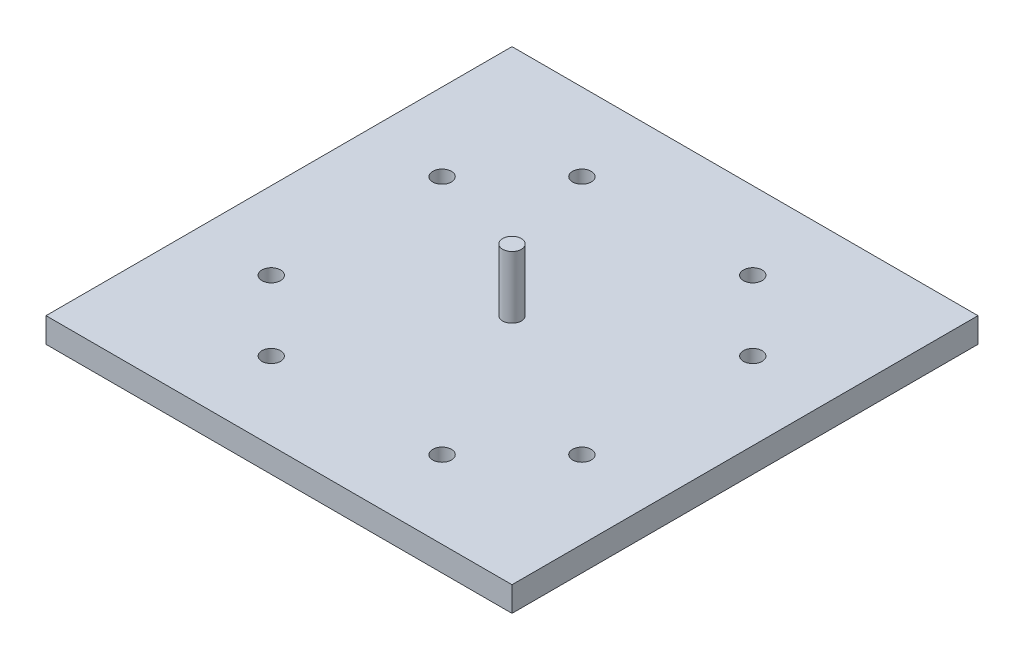
ISO-10303-21;
HEADER;
FILE_DESCRIPTION(('STEP AP214'),'2;1');
FILE_NAME('part.step','',(''),(''),'','','');
FILE_SCHEMA(('AUTOMOTIVE_DESIGN { 1 0 10303 214 1 1 1 1 }'));
ENDSEC;
DATA;
#1=APPLICATION_CONTEXT('core data for automotive mechanical design processes');
#2=APPLICATION_PROTOCOL_DEFINITION('international standard','automotive_design',2000,#1);
#3=PRODUCT_CONTEXT('',#1,'mechanical');
#4=PRODUCT('Part','Part','',(#3));
#5=PRODUCT_RELATED_PRODUCT_CATEGORY('part','',(#4));
#6=PRODUCT_DEFINITION_FORMATION('','',#4);
#7=PRODUCT_DEFINITION_CONTEXT('part definition',#1,'design');
#8=PRODUCT_DEFINITION('design','',#6,#7);
#9=PRODUCT_DEFINITION_SHAPE('','',#8);
#10=(LENGTH_UNIT() NAMED_UNIT(*) SI_UNIT(.MILLI.,.METRE.));
#11=(NAMED_UNIT(*) PLANE_ANGLE_UNIT() SI_UNIT($,.RADIAN.));
#12=(NAMED_UNIT(*) SI_UNIT($,.STERADIAN.) SOLID_ANGLE_UNIT());
#13=UNCERTAINTY_MEASURE_WITH_UNIT(LENGTH_MEASURE(1.E-05),#10,'distance_accuracy_value','');
#14=(GEOMETRIC_REPRESENTATION_CONTEXT(3) GLOBAL_UNCERTAINTY_ASSIGNED_CONTEXT((#13)) GLOBAL_UNIT_ASSIGNED_CONTEXT((#10,
#11,#12)) REPRESENTATION_CONTEXT('',''));
#15=CARTESIAN_POINT('',(0.,0.,0.));
#16=DIRECTION('',(0.,0.,1.));
#17=DIRECTION('',(1.,0.,0.));
#18=AXIS2_PLACEMENT_3D('',#15,#16,#17);
#19=CARTESIAN_POINT('',(0.,1.6,0.));
#20=DIRECTION('',(0.,0.,-1.));
#21=DIRECTION('',(-1.,0.,0.));
#22=AXIS2_PLACEMENT_3D('',#19,#20,#21);
#23=PLANE('',#22);
#24=DIRECTION('',(1.,0.,0.));
#25=VECTOR('',#24,1.);
#26=CARTESIAN_POINT('',(0.,0.,0.));
#27=LINE('',#26,#25);
#28=CARTESIAN_POINT('',(0.,0.,0.));
#29=VERTEX_POINT('',#28);
#30=CARTESIAN_POINT('',(30.,0.,0.));
#31=VERTEX_POINT('',#30);
#32=EDGE_CURVE('E111',#29,#31,#27,.T.);
#33=ORIENTED_EDGE('',*,*,#32,.T.);
#34=DIRECTION('',(0.,-1.,0.));
#35=VECTOR('',#34,1.);
#36=CARTESIAN_POINT('',(30.,1.6,0.));
#37=LINE('',#36,#35);
#38=CARTESIAN_POINT('',(30.,1.6,0.));
#39=VERTEX_POINT('',#38);
#40=EDGE_CURVE('E11',#39,#31,#37,.T.);
#41=ORIENTED_EDGE('',*,*,#40,.F.);
#42=DIRECTION('',(1.,0.,0.));
#43=VECTOR('',#42,1.);
#44=CARTESIAN_POINT('',(0.,1.6,0.));
#45=LINE('',#44,#43);
#46=CARTESIAN_POINT('',(0.,1.6,0.));
#47=VERTEX_POINT('',#46);
#48=EDGE_CURVE('E93',#47,#39,#45,.T.);
#49=ORIENTED_EDGE('',*,*,#48,.F.);
#50=DIRECTION('',(0.,-1.,0.));
#51=VECTOR('',#50,1.);
#52=CARTESIAN_POINT('',(0.,1.6,0.));
#53=LINE('',#52,#51);
#54=EDGE_CURVE('E60',#47,#29,#53,.T.);
#55=ORIENTED_EDGE('',*,*,#54,.T.);
#56=EDGE_LOOP('',(#33,#41,#49,#55));
#57=FACE_BOUND('',#56,.T.);
#58=ADVANCED_FACE('F43',(#57),#23,.F.);
#59=CARTESIAN_POINT('',(30.,1.6,0.));
#60=DIRECTION('',(-1.,0.,0.));
#61=DIRECTION('',(0.,0.,1.));
#62=AXIS2_PLACEMENT_3D('',#59,#60,#61);
#63=PLANE('',#62);
#64=DIRECTION('',(0.,0.,-1.));
#65=VECTOR('',#64,1.);
#66=CARTESIAN_POINT('',(30.,0.,0.));
#67=LINE('',#66,#65);
#68=CARTESIAN_POINT('',(30.,0.,-30.));
#69=VERTEX_POINT('',#68);
#70=EDGE_CURVE('E99',#31,#69,#67,.T.);
#71=ORIENTED_EDGE('',*,*,#70,.T.);
#72=DIRECTION('',(0.,-1.,0.));
#73=VECTOR('',#72,1.);
#74=CARTESIAN_POINT('',(30.,1.6,-30.));
#75=LINE('',#74,#73);
#76=CARTESIAN_POINT('',(30.,1.6,-30.));
#77=VERTEX_POINT('',#76);
#78=EDGE_CURVE('E52',#77,#69,#75,.T.);
#79=ORIENTED_EDGE('',*,*,#78,.F.);
#80=DIRECTION('',(0.,0.,-1.));
#81=VECTOR('',#80,1.);
#82=CARTESIAN_POINT('',(30.,1.6,0.));
#83=LINE('',#82,#81);
#84=EDGE_CURVE('E85',#39,#77,#83,.T.);
#85=ORIENTED_EDGE('',*,*,#84,.F.);
#86=ORIENTED_EDGE('',*,*,#40,.T.);
#87=EDGE_LOOP('',(#71,#79,#85,#86));
#88=FACE_BOUND('',#87,.T.);
#89=ADVANCED_FACE('F98',(#88),#63,.F.);
#90=CARTESIAN_POINT('',(0.,1.6,-30.));
#91=DIRECTION('',(0.,0.,-1.));
#92=DIRECTION('',(-1.,0.,0.));
#93=AXIS2_PLACEMENT_3D('',#90,#91,#92);
#94=PLANE('',#93);
#95=DIRECTION('',(1.,0.,0.));
#96=VECTOR('',#95,1.);
#97=CARTESIAN_POINT('',(0.,0.,-30.));
#98=LINE('',#97,#96);
#99=CARTESIAN_POINT('',(0.,0.,-30.));
#100=VERTEX_POINT('',#99);
#101=EDGE_CURVE('E117',#100,#69,#98,.T.);
#102=ORIENTED_EDGE('',*,*,#101,.F.);
#103=DIRECTION('',(0.,-1.,0.));
#104=VECTOR('',#103,1.);
#105=CARTESIAN_POINT('',(0.,1.6,-30.));
#106=LINE('',#105,#104);
#107=CARTESIAN_POINT('',(0.,1.6,-30.));
#108=VERTEX_POINT('',#107);
#109=EDGE_CURVE('E74',#108,#100,#106,.T.);
#110=ORIENTED_EDGE('',*,*,#109,.F.);
#111=DIRECTION('',(1.,0.,0.));
#112=VECTOR('',#111,1.);
#113=CARTESIAN_POINT('',(0.,1.6,-30.));
#114=LINE('',#113,#112);
#115=EDGE_CURVE('E92',#108,#77,#114,.T.);
#116=ORIENTED_EDGE('',*,*,#115,.T.);
#117=ORIENTED_EDGE('',*,*,#78,.T.);
#118=EDGE_LOOP('',(#102,#110,#116,#117));
#119=FACE_BOUND('',#118,.T.);
#120=ADVANCED_FACE('F103',(#119),#94,.T.);
#121=CARTESIAN_POINT('',(0.,1.6,0.));
#122=DIRECTION('',(-1.,0.,0.));
#123=DIRECTION('',(0.,0.,1.));
#124=AXIS2_PLACEMENT_3D('',#121,#122,#123);
#125=PLANE('',#124);
#126=DIRECTION('',(0.,0.,-1.));
#127=VECTOR('',#126,1.);
#128=CARTESIAN_POINT('',(0.,0.,0.));
#129=LINE('',#128,#127);
#130=EDGE_CURVE('E120',#29,#100,#129,.T.);
#131=ORIENTED_EDGE('',*,*,#130,.F.);
#132=ORIENTED_EDGE('',*,*,#54,.F.);
#133=DIRECTION('',(0.,0.,-1.));
#134=VECTOR('',#133,1.);
#135=CARTESIAN_POINT('',(0.,1.6,0.));
#136=LINE('',#135,#134);
#137=EDGE_CURVE('E105',#47,#108,#136,.T.);
#138=ORIENTED_EDGE('',*,*,#137,.T.);
#139=ORIENTED_EDGE('',*,*,#109,.T.);
#140=EDGE_LOOP('',(#131,#132,#138,#139));
#141=FACE_BOUND('',#140,.T.);
#142=ADVANCED_FACE('F214',(#141),#125,.T.);
#143=CARTESIAN_POINT('',(0.,1.6,0.));
#144=DIRECTION('',(0.,1.,0.));
#145=DIRECTION('',(0.,0.,1.));
#146=AXIS2_PLACEMENT_3D('',#143,#144,#145);
#147=PLANE('',#146);
#148=CARTESIAN_POINT('',(15.,1.6,-15.));
#149=DIRECTION('',(0.,1.,0.));
#150=DIRECTION('',(0.,0.,1.));
#151=AXIS2_PLACEMENT_3D('',#148,#149,#150);
#152=CIRCLE('',#151,0.6);
#153=CARTESIAN_POINT('',(15.,1.6,-14.4));
#154=VERTEX_POINT('',#153);
#155=EDGE_CURVE('E194',#154,#154,#152,.T.);
#156=ORIENTED_EDGE('',*,*,#155,.F.);
#157=EDGE_LOOP('',(#156));
#158=FACE_BOUND('',#157,.T.);
#159=CARTESIAN_POINT('',(25.,1.6,-9.50000000000003));
#160=DIRECTION('',(0.,1.,0.));
#161=DIRECTION('',(-1.,0.,0.));
#162=AXIS2_PLACEMENT_3D('',#159,#160,#161);
#163=CIRCLE('',#162,0.6);
#164=CARTESIAN_POINT('',(24.4,1.6,-9.50000000000003));
#165=VERTEX_POINT('',#164);
#166=EDGE_CURVE('E179',#165,#165,#163,.T.);
#167=ORIENTED_EDGE('',*,*,#166,.F.);
#168=EDGE_LOOP('',(#167));
#169=FACE_BOUND('',#168,.T.);
#170=CARTESIAN_POINT('',(4.99999999999998,1.6,-20.5));
#171=DIRECTION('',(0.,1.,0.));
#172=DIRECTION('',(-1.,0.,0.));
#173=AXIS2_PLACEMENT_3D('',#170,#171,#172);
#174=CIRCLE('',#173,0.6);
#175=CARTESIAN_POINT('',(4.39999999999998,1.6,-20.5));
#176=VERTEX_POINT('',#175);
#177=EDGE_CURVE('E170',#176,#176,#174,.T.);
#178=ORIENTED_EDGE('',*,*,#177,.F.);
#179=EDGE_LOOP('',(#178));
#180=FACE_BOUND('',#179,.T.);
#181=CARTESIAN_POINT('',(5.00000000000002,1.6,-9.49999999999996));
#182=DIRECTION('',(0.,1.,0.));
#183=DIRECTION('',(1.,0.,0.));
#184=AXIS2_PLACEMENT_3D('',#181,#182,#183);
#185=CIRCLE('',#184,0.6);
#186=CARTESIAN_POINT('',(5.60000000000001,1.6,-9.49999999999996));
#187=VERTEX_POINT('',#186);
#188=EDGE_CURVE('E186',#187,#187,#185,.T.);
#189=ORIENTED_EDGE('',*,*,#188,.F.);
#190=EDGE_LOOP('',(#189));
#191=FACE_BOUND('',#190,.T.);
#192=CARTESIAN_POINT('',(25.,1.6,-20.5));
#193=DIRECTION('',(0.,1.,0.));
#194=DIRECTION('',(1.,0.,0.));
#195=AXIS2_PLACEMENT_3D('',#192,#193,#194);
#196=CIRCLE('',#195,0.6);
#197=CARTESIAN_POINT('',(25.6,1.6,-20.5));
#198=VERTEX_POINT('',#197);
#199=EDGE_CURVE('E162',#198,#198,#196,.T.);
#200=ORIENTED_EDGE('',*,*,#199,.F.);
#201=EDGE_LOOP('',(#200));
#202=FACE_BOUND('',#201,.T.);
#203=CARTESIAN_POINT('',(9.5,1.6,-5.));
#204=DIRECTION('',(0.,1.,0.));
#205=DIRECTION('',(0.,0.,-1.));
#206=AXIS2_PLACEMENT_3D('',#203,#204,#205);
#207=CIRCLE('',#206,0.6);
#208=CARTESIAN_POINT('',(9.5,1.6,-5.6));
#209=VERTEX_POINT('',#208);
#210=EDGE_CURVE('E147',#209,#209,#207,.T.);
#211=ORIENTED_EDGE('',*,*,#210,.F.);
#212=EDGE_LOOP('',(#211));
#213=FACE_BOUND('',#212,.T.);
#214=CARTESIAN_POINT('',(20.5,1.6,-25.));
#215=DIRECTION('',(0.,1.,0.));
#216=DIRECTION('',(0.,0.,-1.));
#217=AXIS2_PLACEMENT_3D('',#214,#215,#216);
#218=CIRCLE('',#217,0.6);
#219=CARTESIAN_POINT('',(20.5,1.6,-25.6));
#220=VERTEX_POINT('',#219);
#221=EDGE_CURVE('E138',#220,#220,#218,.T.);
#222=ORIENTED_EDGE('',*,*,#221,.F.);
#223=EDGE_LOOP('',(#222));
#224=FACE_BOUND('',#223,.T.);
#225=CARTESIAN_POINT('',(9.5,1.6,-25.));
#226=DIRECTION('',(0.,1.,0.));
#227=DIRECTION('',(0.,0.,1.));
#228=AXIS2_PLACEMENT_3D('',#225,#226,#227);
#229=CIRCLE('',#228,0.6);
#230=CARTESIAN_POINT('',(9.5,1.6,-24.4));
#231=VERTEX_POINT('',#230);
#232=EDGE_CURVE('E154',#231,#231,#229,.T.);
#233=ORIENTED_EDGE('',*,*,#232,.F.);
#234=EDGE_LOOP('',(#233));
#235=FACE_BOUND('',#234,.T.);
#236=CARTESIAN_POINT('',(20.5,1.6,-5.));
#237=DIRECTION('',(0.,1.,0.));
#238=DIRECTION('',(0.,0.,1.));
#239=AXIS2_PLACEMENT_3D('',#236,#237,#238);
#240=CIRCLE('',#239,0.6);
#241=CARTESIAN_POINT('',(20.5,1.6,-4.4));
#242=VERTEX_POINT('',#241);
#243=EDGE_CURVE('E130',#242,#242,#240,.T.);
#244=ORIENTED_EDGE('',*,*,#243,.F.);
#245=EDGE_LOOP('',(#244));
#246=FACE_BOUND('',#245,.T.);
#247=ORIENTED_EDGE('',*,*,#48,.T.);
#248=ORIENTED_EDGE('',*,*,#84,.T.);
#249=ORIENTED_EDGE('',*,*,#115,.F.);
#250=ORIENTED_EDGE('',*,*,#137,.F.);
#251=EDGE_LOOP('',(#247,#248,#249,#250));
#252=FACE_BOUND('',#251,.T.);
#253=ADVANCED_FACE('F89',(#158,#169,#180,#191,#202,#213,#224,#235,#246,#252),#147,.T.);
#254=CARTESIAN_POINT('',(0.,0.,0.));
#255=DIRECTION('',(0.,1.,0.));
#256=DIRECTION('',(0.,0.,1.));
#257=AXIS2_PLACEMENT_3D('',#254,#255,#256);
#258=PLANE('',#257);
#259=CARTESIAN_POINT('',(25.,0.,-9.50000000000003));
#260=DIRECTION('',(0.,1.,0.));
#261=DIRECTION('',(-1.,0.,0.));
#262=AXIS2_PLACEMENT_3D('',#259,#260,#261);
#263=CIRCLE('',#262,0.6);
#264=CARTESIAN_POINT('',(24.4,0.,-9.50000000000003));
#265=VERTEX_POINT('',#264);
#266=EDGE_CURVE('E166',#265,#265,#263,.T.);
#267=ORIENTED_EDGE('',*,*,#266,.T.);
#268=EDGE_LOOP('',(#267));
#269=FACE_BOUND('',#268,.T.);
#270=CARTESIAN_POINT('',(4.99999999999998,0.,-20.5));
#271=DIRECTION('',(0.,1.,0.));
#272=DIRECTION('',(-1.,0.,0.));
#273=AXIS2_PLACEMENT_3D('',#270,#271,#272);
#274=CIRCLE('',#273,0.6);
#275=CARTESIAN_POINT('',(4.39999999999998,0.,-20.5));
#276=VERTEX_POINT('',#275);
#277=EDGE_CURVE('E174',#276,#276,#274,.T.);
#278=ORIENTED_EDGE('',*,*,#277,.T.);
#279=EDGE_LOOP('',(#278));
#280=FACE_BOUND('',#279,.T.);
#281=CARTESIAN_POINT('',(5.00000000000002,0.,-9.49999999999996));
#282=DIRECTION('',(0.,1.,0.));
#283=DIRECTION('',(1.,0.,0.));
#284=AXIS2_PLACEMENT_3D('',#281,#282,#283);
#285=CIRCLE('',#284,0.6);
#286=CARTESIAN_POINT('',(5.60000000000001,0.,-9.49999999999996));
#287=VERTEX_POINT('',#286);
#288=EDGE_CURVE('E175',#287,#287,#285,.T.);
#289=ORIENTED_EDGE('',*,*,#288,.T.);
#290=EDGE_LOOP('',(#289));
#291=FACE_BOUND('',#290,.T.);
#292=CARTESIAN_POINT('',(25.,0.,-20.5));
#293=DIRECTION('',(0.,1.,0.));
#294=DIRECTION('',(1.,0.,0.));
#295=AXIS2_PLACEMENT_3D('',#292,#293,#294);
#296=CIRCLE('',#295,0.6);
#297=CARTESIAN_POINT('',(25.6,0.,-20.5));
#298=VERTEX_POINT('',#297);
#299=EDGE_CURVE('E158',#298,#298,#296,.T.);
#300=ORIENTED_EDGE('',*,*,#299,.T.);
#301=EDGE_LOOP('',(#300));
#302=FACE_BOUND('',#301,.T.);
#303=CARTESIAN_POINT('',(9.5,0.,-5.));
#304=DIRECTION('',(0.,1.,0.));
#305=DIRECTION('',(0.,0.,-1.));
#306=AXIS2_PLACEMENT_3D('',#303,#304,#305);
#307=CIRCLE('',#306,0.6);
#308=CARTESIAN_POINT('',(9.5,0.,-5.6));
#309=VERTEX_POINT('',#308);
#310=EDGE_CURVE('E134',#309,#309,#307,.T.);
#311=ORIENTED_EDGE('',*,*,#310,.T.);
#312=EDGE_LOOP('',(#311));
#313=FACE_BOUND('',#312,.T.);
#314=CARTESIAN_POINT('',(20.5,0.,-25.));
#315=DIRECTION('',(0.,1.,0.));
#316=DIRECTION('',(0.,0.,-1.));
#317=AXIS2_PLACEMENT_3D('',#314,#315,#316);
#318=CIRCLE('',#317,0.6);
#319=CARTESIAN_POINT('',(20.5,0.,-25.6));
#320=VERTEX_POINT('',#319);
#321=EDGE_CURVE('E142',#320,#320,#318,.T.);
#322=ORIENTED_EDGE('',*,*,#321,.T.);
#323=EDGE_LOOP('',(#322));
#324=FACE_BOUND('',#323,.T.);
#325=CARTESIAN_POINT('',(9.5,0.,-25.));
#326=DIRECTION('',(0.,1.,0.));
#327=DIRECTION('',(0.,0.,1.));
#328=AXIS2_PLACEMENT_3D('',#325,#326,#327);
#329=CIRCLE('',#328,0.6);
#330=CARTESIAN_POINT('',(9.5,0.,-24.4));
#331=VERTEX_POINT('',#330);
#332=EDGE_CURVE('E143',#331,#331,#329,.T.);
#333=ORIENTED_EDGE('',*,*,#332,.T.);
#334=EDGE_LOOP('',(#333));
#335=FACE_BOUND('',#334,.T.);
#336=CARTESIAN_POINT('',(20.5,0.,-5.));
#337=DIRECTION('',(0.,1.,0.));
#338=DIRECTION('',(0.,0.,1.));
#339=AXIS2_PLACEMENT_3D('',#336,#337,#338);
#340=CIRCLE('',#339,0.6);
#341=CARTESIAN_POINT('',(20.5,0.,-4.4));
#342=VERTEX_POINT('',#341);
#343=EDGE_CURVE('E114',#342,#342,#340,.T.);
#344=ORIENTED_EDGE('',*,*,#343,.T.);
#345=EDGE_LOOP('',(#344));
#346=FACE_BOUND('',#345,.T.);
#347=ORIENTED_EDGE('',*,*,#32,.F.);
#348=ORIENTED_EDGE('',*,*,#130,.T.);
#349=ORIENTED_EDGE('',*,*,#101,.T.);
#350=ORIENTED_EDGE('',*,*,#70,.F.);
#351=EDGE_LOOP('',(#347,#348,#349,#350));
#352=FACE_BOUND('',#351,.T.);
#353=ADVANCED_FACE('F213',(#269,#280,#291,#302,#313,#324,#335,#346,#352),#258,.F.);
#354=CARTESIAN_POINT('',(20.5,0.,-5.));
#355=DIRECTION('',(0.,1.,0.));
#356=DIRECTION('',(0.,0.,1.));
#357=AXIS2_PLACEMENT_3D('',#354,#355,#356);
#358=CYLINDRICAL_SURFACE('',#357,0.6);
#359=ORIENTED_EDGE('',*,*,#343,.F.);
#360=EDGE_LOOP('',(#359));
#361=FACE_BOUND('',#360,.T.);
#362=ORIENTED_EDGE('',*,*,#243,.T.);
#363=EDGE_LOOP('',(#362));
#364=FACE_BOUND('',#363,.T.);
#365=ADVANCED_FACE('F232',(#361,#364),#358,.F.);
#366=CARTESIAN_POINT('',(9.5,0.,-25.));
#367=DIRECTION('',(0.,1.,0.));
#368=DIRECTION('',(0.,0.,1.));
#369=AXIS2_PLACEMENT_3D('',#366,#367,#368);
#370=CYLINDRICAL_SURFACE('',#369,0.6);
#371=ORIENTED_EDGE('',*,*,#332,.F.);
#372=EDGE_LOOP('',(#371));
#373=FACE_BOUND('',#372,.T.);
#374=ORIENTED_EDGE('',*,*,#232,.T.);
#375=EDGE_LOOP('',(#374));
#376=FACE_BOUND('',#375,.T.);
#377=ADVANCED_FACE('F234',(#373,#376),#370,.F.);
#378=CARTESIAN_POINT('',(20.5,0.,-25.));
#379=DIRECTION('',(0.,1.,0.));
#380=DIRECTION('',(0.,0.,1.));
#381=AXIS2_PLACEMENT_3D('',#378,#379,#380);
#382=CYLINDRICAL_SURFACE('',#381,0.6);
#383=ORIENTED_EDGE('',*,*,#321,.F.);
#384=EDGE_LOOP('',(#383));
#385=FACE_BOUND('',#384,.T.);
#386=ORIENTED_EDGE('',*,*,#221,.T.);
#387=EDGE_LOOP('',(#386));
#388=FACE_BOUND('',#387,.T.);
#389=ADVANCED_FACE('F241',(#385,#388),#382,.F.);
#390=CARTESIAN_POINT('',(9.5,0.,-5.));
#391=DIRECTION('',(0.,1.,0.));
#392=DIRECTION('',(0.,0.,1.));
#393=AXIS2_PLACEMENT_3D('',#390,#391,#392);
#394=CYLINDRICAL_SURFACE('',#393,0.6);
#395=ORIENTED_EDGE('',*,*,#310,.F.);
#396=EDGE_LOOP('',(#395));
#397=FACE_BOUND('',#396,.T.);
#398=ORIENTED_EDGE('',*,*,#210,.T.);
#399=EDGE_LOOP('',(#398));
#400=FACE_BOUND('',#399,.T.);
#401=ADVANCED_FACE('F313',(#397,#400),#394,.F.);
#402=CARTESIAN_POINT('',(25.,0.,-20.5));
#403=DIRECTION('',(0.,1.,0.));
#404=DIRECTION('',(0.,0.,1.));
#405=AXIS2_PLACEMENT_3D('',#402,#403,#404);
#406=CYLINDRICAL_SURFACE('',#405,0.6);
#407=ORIENTED_EDGE('',*,*,#299,.F.);
#408=EDGE_LOOP('',(#407));
#409=FACE_BOUND('',#408,.T.);
#410=ORIENTED_EDGE('',*,*,#199,.T.);
#411=EDGE_LOOP('',(#410));
#412=FACE_BOUND('',#411,.T.);
#413=ADVANCED_FACE('F320',(#409,#412),#406,.F.);
#414=CARTESIAN_POINT('',(5.00000000000002,0.,-9.49999999999996));
#415=DIRECTION('',(0.,1.,0.));
#416=DIRECTION('',(0.,0.,1.));
#417=AXIS2_PLACEMENT_3D('',#414,#415,#416);
#418=CYLINDRICAL_SURFACE('',#417,0.6);
#419=ORIENTED_EDGE('',*,*,#288,.F.);
#420=EDGE_LOOP('',(#419));
#421=FACE_BOUND('',#420,.T.);
#422=ORIENTED_EDGE('',*,*,#188,.T.);
#423=EDGE_LOOP('',(#422));
#424=FACE_BOUND('',#423,.T.);
#425=ADVANCED_FACE('F328',(#421,#424),#418,.F.);
#426=CARTESIAN_POINT('',(4.99999999999998,0.,-20.5));
#427=DIRECTION('',(0.,1.,0.));
#428=DIRECTION('',(0.,0.,1.));
#429=AXIS2_PLACEMENT_3D('',#426,#427,#428);
#430=CYLINDRICAL_SURFACE('',#429,0.6);
#431=ORIENTED_EDGE('',*,*,#277,.F.);
#432=EDGE_LOOP('',(#431));
#433=FACE_BOUND('',#432,.T.);
#434=ORIENTED_EDGE('',*,*,#177,.T.);
#435=EDGE_LOOP('',(#434));
#436=FACE_BOUND('',#435,.T.);
#437=ADVANCED_FACE('F337',(#433,#436),#430,.F.);
#438=CARTESIAN_POINT('',(25.,0.,-9.50000000000003));
#439=DIRECTION('',(0.,1.,0.));
#440=DIRECTION('',(0.,0.,1.));
#441=AXIS2_PLACEMENT_3D('',#438,#439,#440);
#442=CYLINDRICAL_SURFACE('',#441,0.6);
#443=ORIENTED_EDGE('',*,*,#266,.F.);
#444=EDGE_LOOP('',(#443));
#445=FACE_BOUND('',#444,.T.);
#446=ORIENTED_EDGE('',*,*,#166,.T.);
#447=EDGE_LOOP('',(#446));
#448=FACE_BOUND('',#447,.T.);
#449=ADVANCED_FACE('F207',(#445,#448),#442,.F.);
#450=CARTESIAN_POINT('',(15.,5.6,-15.));
#451=DIRECTION('',(0.,-1.,0.));
#452=DIRECTION('',(0.,0.,-1.));
#453=AXIS2_PLACEMENT_3D('',#450,#451,#452);
#454=CYLINDRICAL_SURFACE('',#453,0.6);
#455=CARTESIAN_POINT('',(15.,5.6,-15.));
#456=DIRECTION('',(0.,1.,0.));
#457=DIRECTION('',(0.,0.,1.));
#458=AXIS2_PLACEMENT_3D('',#455,#456,#457);
#459=CIRCLE('',#458,0.6);
#460=CARTESIAN_POINT('',(15.,5.6,-14.4));
#461=VERTEX_POINT('',#460);
#462=EDGE_CURVE('E190',#461,#461,#459,.T.);
#463=ORIENTED_EDGE('',*,*,#462,.F.);
#464=EDGE_LOOP('',(#463));
#465=FACE_BOUND('',#464,.T.);
#466=ORIENTED_EDGE('',*,*,#155,.T.);
#467=EDGE_LOOP('',(#466));
#468=FACE_BOUND('',#467,.T.);
#469=ADVANCED_FACE('F204',(#465,#468),#454,.T.);
#470=CARTESIAN_POINT('',(15.,5.6,-15.));
#471=DIRECTION('',(0.,1.,0.));
#472=DIRECTION('',(0.,0.,1.));
#473=AXIS2_PLACEMENT_3D('',#470,#471,#472);
#474=PLANE('',#473);
#475=ORIENTED_EDGE('',*,*,#462,.T.);
#476=EDGE_LOOP('',(#475));
#477=FACE_BOUND('',#476,.T.);
#478=ADVANCED_FACE('F202',(#477),#474,.T.);
#479=CLOSED_SHELL('',(#58,#89,#120,#142,#253,#353,#365,#377,#389,#401,#413,#425,#437,#449,#469,#478));
#480=MANIFOLD_SOLID_BREP('B2',#479);
#481=ADVANCED_BREP_SHAPE_REPRESENTATION('',(#18,#480),#14);
#482=SHAPE_DEFINITION_REPRESENTATION(#9,#481);
ENDSEC;
END-ISO-10303-21;
